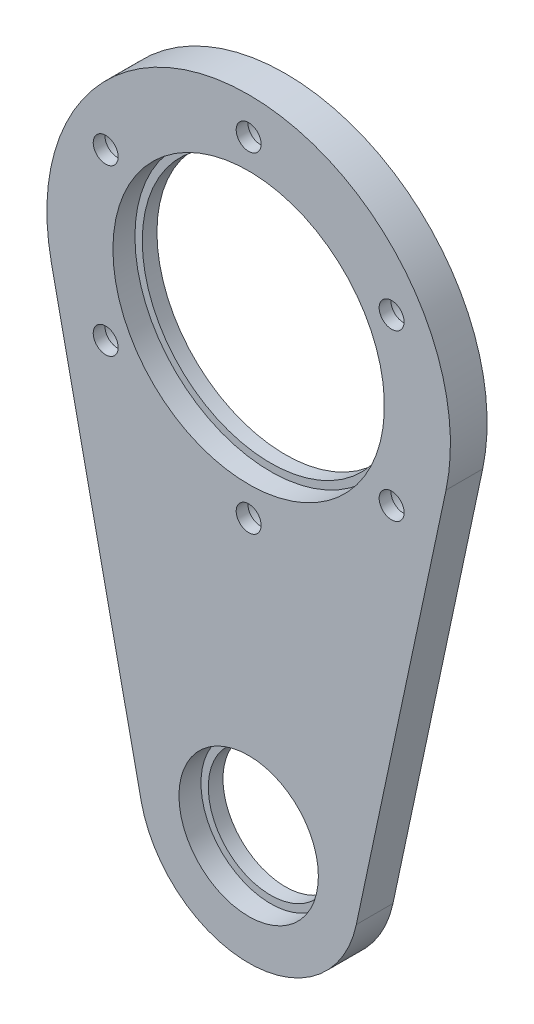
ISO-10303-21;
HEADER;
FILE_DESCRIPTION(('STEP AP214'),'2;1');
FILE_NAME('part.step','',(''),(''),'','','');
FILE_SCHEMA(('AUTOMOTIVE_DESIGN { 1 0 10303 214 1 1 1 1 }'));
ENDSEC;
DATA;
#1=APPLICATION_CONTEXT('core data for automotive mechanical design processes');
#2=APPLICATION_PROTOCOL_DEFINITION('international standard','automotive_design',2000,#1);
#3=PRODUCT_CONTEXT('',#1,'mechanical');
#4=PRODUCT('Part','Part','',(#3));
#5=PRODUCT_RELATED_PRODUCT_CATEGORY('part','',(#4));
#6=PRODUCT_DEFINITION_FORMATION('','',#4);
#7=PRODUCT_DEFINITION_CONTEXT('part definition',#1,'design');
#8=PRODUCT_DEFINITION('design','',#6,#7);
#9=PRODUCT_DEFINITION_SHAPE('','',#8);
#10=(LENGTH_UNIT() NAMED_UNIT(*) SI_UNIT(.MILLI.,.METRE.));
#11=(NAMED_UNIT(*) PLANE_ANGLE_UNIT() SI_UNIT($,.RADIAN.));
#12=(NAMED_UNIT(*) SI_UNIT($,.STERADIAN.) SOLID_ANGLE_UNIT());
#13=UNCERTAINTY_MEASURE_WITH_UNIT(LENGTH_MEASURE(1.E-05),#10,'distance_accuracy_value','');
#14=(GEOMETRIC_REPRESENTATION_CONTEXT(3) GLOBAL_UNCERTAINTY_ASSIGNED_CONTEXT((#13)) GLOBAL_UNIT_ASSIGNED_CONTEXT((#10,
#11,#12)) REPRESENTATION_CONTEXT('',''));
#15=CARTESIAN_POINT('',(0.,0.,0.));
#16=DIRECTION('',(0.,0.,1.));
#17=DIRECTION('',(1.,0.,0.));
#18=AXIS2_PLACEMENT_3D('',#15,#16,#17);
#19=CARTESIAN_POINT('',(0.,0.,-5.));
#20=DIRECTION('',(0.,0.,-1.));
#21=DIRECTION('',(-1.,0.,0.));
#22=AXIS2_PLACEMENT_3D('',#19,#20,#21);
#23=CYLINDRICAL_SURFACE('',#22,18.5);
#24=CARTESIAN_POINT('',(0.,0.,-8.));
#25=DIRECTION('',(0.,0.,-1.));
#26=DIRECTION('',(-1.,0.,0.));
#27=AXIS2_PLACEMENT_3D('',#24,#25,#26);
#28=CIRCLE('',#27,18.5);
#29=CARTESIAN_POINT('',(-18.5,0.,-8.));
#30=VERTEX_POINT('',#29);
#31=EDGE_CURVE('E96',#30,#30,#28,.F.);
#32=ORIENTED_EDGE('',*,*,#31,.T.);
#33=EDGE_LOOP('',(#32));
#34=FACE_BOUND('',#33,.T.);
#35=CARTESIAN_POINT('',(0.,0.,-11.));
#36=DIRECTION('',(0.,0.,-1.));
#37=DIRECTION('',(-1.,0.,0.));
#38=AXIS2_PLACEMENT_3D('',#35,#36,#37);
#39=CIRCLE('',#38,18.5);
#40=CARTESIAN_POINT('',(-18.5,0.,-11.));
#41=VERTEX_POINT('',#40);
#42=EDGE_CURVE('E11',#41,#41,#39,.F.);
#43=ORIENTED_EDGE('',*,*,#42,.F.);
#44=EDGE_LOOP('',(#43));
#45=FACE_BOUND('',#44,.T.);
#46=ADVANCED_FACE('F40',(#34,#45),#23,.F.);
#47=CARTESIAN_POINT('',(0.,0.,-2.));
#48=DIRECTION('',(0.,0.,1.));
#49=DIRECTION('',(1.,0.,0.));
#50=AXIS2_PLACEMENT_3D('',#47,#48,#49);
#51=CYLINDRICAL_SURFACE('',#50,27.5);
#52=DIRECTION('',(0.,0.,-1.));
#53=VECTOR('',#52,1.);
#54=CARTESIAN_POINT('',(-26.8965917786168,-5.72916666666667,-4.));
#55=LINE('',#54,#53);
#56=CARTESIAN_POINT('',(-26.8965917786168,-5.72916666666667,-8.));
#57=VERTEX_POINT('',#56);
#58=CARTESIAN_POINT('',(-26.8965917786168,-5.72916666666667,-13.));
#59=VERTEX_POINT('',#58);
#60=EDGE_CURVE('E65',#57,#59,#55,.T.);
#61=ORIENTED_EDGE('',*,*,#60,.F.);
#62=CARTESIAN_POINT('',(0.,0.,-8.));
#63=DIRECTION('',(0.,0.,-1.));
#64=DIRECTION('',(-1.,0.,0.));
#65=AXIS2_PLACEMENT_3D('',#62,#63,#64);
#66=CIRCLE('',#65,27.5);
#67=CARTESIAN_POINT('',(26.8965917786168,-5.72916666666667,-8.));
#68=VERTEX_POINT('',#67);
#69=EDGE_CURVE('E86',#57,#68,#66,.T.);
#70=ORIENTED_EDGE('',*,*,#69,.T.);
#71=DIRECTION('',(0.,0.,-1.));
#72=VECTOR('',#71,1.);
#73=CARTESIAN_POINT('',(26.8965917786168,-5.72916666666667,-4.));
#74=LINE('',#73,#72);
#75=CARTESIAN_POINT('',(26.8965917786168,-5.72916666666667,-13.));
#76=VERTEX_POINT('',#75);
#77=EDGE_CURVE('E94',#68,#76,#74,.T.);
#78=ORIENTED_EDGE('',*,*,#77,.T.);
#79=CARTESIAN_POINT('',(0.,0.,-13.));
#80=DIRECTION('',(0.,0.,-1.));
#81=DIRECTION('',(-1.,0.,0.));
#82=AXIS2_PLACEMENT_3D('',#79,#80,#81);
#83=CIRCLE('',#82,27.5);
#84=EDGE_CURVE('E49',#59,#76,#83,.T.);
#85=ORIENTED_EDGE('',*,*,#84,.F.);
#86=EDGE_LOOP('',(#61,#70,#78,#85));
#87=FACE_BOUND('',#86,.T.);
#88=ADVANCED_FACE('F42',(#87),#51,.T.);
#89=CARTESIAN_POINT('',(0.,0.,-13.));
#90=DIRECTION('',(0.,0.,-1.));
#91=DIRECTION('',(-1.,0.,0.));
#92=AXIS2_PLACEMENT_3D('',#89,#90,#91);
#93=PLANE('',#92);
#94=CARTESIAN_POINT('',(-19.4855715851497,11.2500000000002,-13.));
#95=DIRECTION('',(0.,0.,-1.));
#96=DIRECTION('',(-1.,0.,0.));
#97=AXIS2_PLACEMENT_3D('',#94,#95,#96);
#98=CIRCLE('',#97,3.25);
#99=CARTESIAN_POINT('',(-22.7355715851497,11.2500000000002,-13.));
#100=VERTEX_POINT('',#99);
#101=EDGE_CURVE('E331',#100,#100,#98,.T.);
#102=ORIENTED_EDGE('',*,*,#101,.F.);
#103=EDGE_LOOP('',(#102));
#104=FACE_BOUND('',#103,.T.);
#105=CARTESIAN_POINT('',(-19.48557158515,-11.2499999999998,-13.));
#106=DIRECTION('',(0.,0.,-1.));
#107=DIRECTION('',(-1.,0.,0.));
#108=AXIS2_PLACEMENT_3D('',#105,#106,#107);
#109=CIRCLE('',#108,3.25);
#110=CARTESIAN_POINT('',(-22.73557158515,-11.2499999999998,-13.));
#111=VERTEX_POINT('',#110);
#112=EDGE_CURVE('E150',#111,#111,#109,.T.);
#113=ORIENTED_EDGE('',*,*,#112,.F.);
#114=EDGE_LOOP('',(#113));
#115=FACE_BOUND('',#114,.T.);
#116=CARTESIAN_POINT('',(0.,-22.5,-13.));
#117=DIRECTION('',(0.,0.,-1.));
#118=DIRECTION('',(-1.,0.,0.));
#119=AXIS2_PLACEMENT_3D('',#116,#117,#118);
#120=CIRCLE('',#119,3.25);
#121=CARTESIAN_POINT('',(-3.25,-22.5,-13.));
#122=VERTEX_POINT('',#121);
#123=EDGE_CURVE('E137',#122,#122,#120,.T.);
#124=ORIENTED_EDGE('',*,*,#123,.F.);
#125=EDGE_LOOP('',(#124));
#126=FACE_BOUND('',#125,.T.);
#127=CARTESIAN_POINT('',(19.4855715851498,-11.2500000000001,-13.));
#128=DIRECTION('',(0.,0.,-1.));
#129=DIRECTION('',(-1.,0.,0.));
#130=AXIS2_PLACEMENT_3D('',#127,#128,#129);
#131=CIRCLE('',#130,3.25);
#132=CARTESIAN_POINT('',(16.2355715851498,-11.2500000000001,-13.));
#133=VERTEX_POINT('',#132);
#134=EDGE_CURVE('E133',#133,#133,#131,.T.);
#135=ORIENTED_EDGE('',*,*,#134,.F.);
#136=EDGE_LOOP('',(#135));
#137=FACE_BOUND('',#136,.T.);
#138=CARTESIAN_POINT('',(19.4855715851499,11.25,-13.));
#139=DIRECTION('',(0.,0.,-1.));
#140=DIRECTION('',(-1.,0.,0.));
#141=AXIS2_PLACEMENT_3D('',#138,#139,#140);
#142=CIRCLE('',#141,3.25);
#143=CARTESIAN_POINT('',(16.2355715851499,11.25,-13.));
#144=VERTEX_POINT('',#143);
#145=EDGE_CURVE('E129',#144,#144,#142,.T.);
#146=ORIENTED_EDGE('',*,*,#145,.F.);
#147=EDGE_LOOP('',(#146));
#148=FACE_BOUND('',#147,.T.);
#149=CARTESIAN_POINT('',(0.,22.5,-13.));
#150=DIRECTION('',(0.,0.,-1.));
#151=DIRECTION('',(-1.,0.,0.));
#152=AXIS2_PLACEMENT_3D('',#149,#150,#151);
#153=CIRCLE('',#152,3.25);
#154=CARTESIAN_POINT('',(-3.25,22.5,-13.));
#155=VERTEX_POINT('',#154);
#156=EDGE_CURVE('E124',#155,#155,#153,.T.);
#157=ORIENTED_EDGE('',*,*,#156,.F.);
#158=EDGE_LOOP('',(#157));
#159=FACE_BOUND('',#158,.T.);
#160=CARTESIAN_POINT('',(0.,-60.,-13.));
#161=DIRECTION('',(0.,0.,1.));
#162=DIRECTION('',(1.,0.,0.));
#163=AXIS2_PLACEMENT_3D('',#160,#161,#162);
#164=CIRCLE('',#163,8.50000000000001);
#165=CARTESIAN_POINT('',(8.5,-60.,-13.));
#166=VERTEX_POINT('',#165);
#167=EDGE_CURVE('E188',#166,#166,#164,.T.);
#168=ORIENTED_EDGE('',*,*,#167,.T.);
#169=EDGE_LOOP('',(#168));
#170=FACE_BOUND('',#169,.T.);
#171=ORIENTED_EDGE('',*,*,#84,.T.);
#172=DIRECTION('',(-0.208333333333333,-0.978057882858792,0.));
#173=VECTOR('',#172,1.);
#174=CARTESIAN_POINT('',(26.8965917786168,-5.72916666666667,-13.));
#175=LINE('',#174,#173);
#176=CARTESIAN_POINT('',(14.6708682428819,-63.125,-13.));
#177=VERTEX_POINT('',#176);
#178=EDGE_CURVE('E101',#76,#177,#175,.T.);
#179=ORIENTED_EDGE('',*,*,#178,.T.);
#180=CARTESIAN_POINT('',(0.,-60.,-13.));
#181=DIRECTION('',(0.,0.,-1.));
#182=DIRECTION('',(-1.,0.,0.));
#183=AXIS2_PLACEMENT_3D('',#180,#181,#182);
#184=CIRCLE('',#183,15.);
#185=CARTESIAN_POINT('',(-14.6708682428819,-63.125,-13.));
#186=VERTEX_POINT('',#185);
#187=EDGE_CURVE('E108',#177,#186,#184,.T.);
#188=ORIENTED_EDGE('',*,*,#187,.T.);
#189=DIRECTION('',(-0.208333333333333,0.978057882858792,0.));
#190=VECTOR('',#189,1.);
#191=CARTESIAN_POINT('',(-26.8965917786168,-5.72916666666667,-13.));
#192=LINE('',#191,#190);
#193=EDGE_CURVE('E104',#186,#59,#192,.T.);
#194=ORIENTED_EDGE('',*,*,#193,.T.);
#195=EDGE_LOOP('',(#171,#179,#188,#194));
#196=FACE_BOUND('',#195,.T.);
#197=CARTESIAN_POINT('',(0.,0.,-13.));
#198=DIRECTION('',(0.,0.,-1.));
#199=DIRECTION('',(-1.,0.,0.));
#200=AXIS2_PLACEMENT_3D('',#197,#198,#199);
#201=CIRCLE('',#200,17.5);
#202=CARTESIAN_POINT('',(-17.5,0.,-13.));
#203=VERTEX_POINT('',#202);
#204=EDGE_CURVE('E119',#203,#203,#201,.T.);
#205=ORIENTED_EDGE('',*,*,#204,.F.);
#206=EDGE_LOOP('',(#205));
#207=FACE_BOUND('',#206,.T.);
#208=ADVANCED_FACE('F204',(#104,#115,#126,#137,#148,#159,#170,#196,#207),#93,.T.);
#209=CARTESIAN_POINT('',(-26.8965917786168,-5.72916666666667,-4.));
#210=DIRECTION('',(-0.978057882858792,-0.208333333333333,0.));
#211=DIRECTION('',(0.208333333333333,-0.978057882858792,0.));
#212=AXIS2_PLACEMENT_3D('',#209,#210,#211);
#213=PLANE('',#212);
#214=DIRECTION('',(0.208333333333333,-0.978057882858792,0.));
#215=VECTOR('',#214,1.);
#216=CARTESIAN_POINT('',(-26.8965917786168,-5.72916666666667,-8.));
#217=LINE('',#216,#215);
#218=CARTESIAN_POINT('',(-14.6708682428819,-63.125,-8.));
#219=VERTEX_POINT('',#218);
#220=EDGE_CURVE('E97',#57,#219,#217,.T.);
#221=ORIENTED_EDGE('',*,*,#220,.F.);
#222=ORIENTED_EDGE('',*,*,#60,.T.);
#223=ORIENTED_EDGE('',*,*,#193,.F.);
#224=DIRECTION('',(0.,0.,-1.));
#225=VECTOR('',#224,1.);
#226=CARTESIAN_POINT('',(-14.6708682428819,-63.125,-4.));
#227=LINE('',#226,#225);
#228=EDGE_CURVE('E106',#219,#186,#227,.T.);
#229=ORIENTED_EDGE('',*,*,#228,.F.);
#230=EDGE_LOOP('',(#221,#222,#223,#229));
#231=FACE_BOUND('',#230,.T.);
#232=ADVANCED_FACE('F206',(#231),#213,.T.);
#233=CARTESIAN_POINT('',(0.,-60.,-4.));
#234=DIRECTION('',(0.,0.,-1.));
#235=DIRECTION('',(-1.,0.,0.));
#236=AXIS2_PLACEMENT_3D('',#233,#234,#235);
#237=CYLINDRICAL_SURFACE('',#236,15.);
#238=CARTESIAN_POINT('',(0.,-60.,-8.));
#239=DIRECTION('',(0.,0.,-1.));
#240=DIRECTION('',(-1.,0.,0.));
#241=AXIS2_PLACEMENT_3D('',#238,#239,#240);
#242=CIRCLE('',#241,15.);
#243=CARTESIAN_POINT('',(14.6708682428819,-63.125,-8.));
#244=VERTEX_POINT('',#243);
#245=EDGE_CURVE('E57',#219,#244,#242,.F.);
#246=ORIENTED_EDGE('',*,*,#245,.F.);
#247=ORIENTED_EDGE('',*,*,#228,.T.);
#248=ORIENTED_EDGE('',*,*,#187,.F.);
#249=DIRECTION('',(0.,0.,-1.));
#250=VECTOR('',#249,1.);
#251=CARTESIAN_POINT('',(14.6708682428819,-63.125,-4.));
#252=LINE('',#251,#250);
#253=EDGE_CURVE('E103',#244,#177,#252,.T.);
#254=ORIENTED_EDGE('',*,*,#253,.F.);
#255=EDGE_LOOP('',(#246,#247,#248,#254));
#256=FACE_BOUND('',#255,.T.);
#257=ADVANCED_FACE('F202',(#256),#237,.T.);
#258=CARTESIAN_POINT('',(26.8965917786168,-5.72916666666667,-4.));
#259=DIRECTION('',(0.978057882858792,-0.208333333333333,0.));
#260=DIRECTION('',(0.208333333333333,0.978057882858792,0.));
#261=AXIS2_PLACEMENT_3D('',#258,#259,#260);
#262=PLANE('',#261);
#263=DIRECTION('',(0.208333333333333,0.978057882858792,0.));
#264=VECTOR('',#263,1.);
#265=CARTESIAN_POINT('',(26.8965917786168,-5.72916666666667,-8.));
#266=LINE('',#265,#264);
#267=EDGE_CURVE('E82',#244,#68,#266,.T.);
#268=ORIENTED_EDGE('',*,*,#267,.F.);
#269=ORIENTED_EDGE('',*,*,#253,.T.);
#270=ORIENTED_EDGE('',*,*,#178,.F.);
#271=ORIENTED_EDGE('',*,*,#77,.F.);
#272=EDGE_LOOP('',(#268,#269,#270,#271));
#273=FACE_BOUND('',#272,.T.);
#274=ADVANCED_FACE('F99',(#273),#262,.T.);
#275=CARTESIAN_POINT('',(0.,-60.,-11.));
#276=DIRECTION('',(0.,0.,1.));
#277=DIRECTION('',(1.,0.,0.));
#278=AXIS2_PLACEMENT_3D('',#275,#276,#277);
#279=CYLINDRICAL_SURFACE('',#278,9.5);
#280=CARTESIAN_POINT('',(0.,-60.,-8.));
#281=DIRECTION('',(0.,0.,-1.));
#282=DIRECTION('',(-1.,0.,0.));
#283=AXIS2_PLACEMENT_3D('',#280,#281,#282);
#284=CIRCLE('',#283,9.5);
#285=CARTESIAN_POINT('',(-9.5,-60.,-8.));
#286=VERTEX_POINT('',#285);
#287=EDGE_CURVE('E90',#286,#286,#284,.F.);
#288=ORIENTED_EDGE('',*,*,#287,.T.);
#289=EDGE_LOOP('',(#288));
#290=FACE_BOUND('',#289,.T.);
#291=CARTESIAN_POINT('',(0.,-60.,-11.));
#292=DIRECTION('',(0.,0.,1.));
#293=DIRECTION('',(1.,0.,0.));
#294=AXIS2_PLACEMENT_3D('',#291,#292,#293);
#295=CIRCLE('',#294,9.5);
#296=CARTESIAN_POINT('',(9.49999999999999,-60.,-11.));
#297=VERTEX_POINT('',#296);
#298=EDGE_CURVE('E191',#297,#297,#295,.T.);
#299=ORIENTED_EDGE('',*,*,#298,.F.);
#300=EDGE_LOOP('',(#299));
#301=FACE_BOUND('',#300,.T.);
#302=ADVANCED_FACE('F225',(#290,#301),#279,.F.);
#303=CARTESIAN_POINT('',(0.,-60.,-11.));
#304=DIRECTION('',(0.,0.,1.));
#305=DIRECTION('',(1.,0.,0.));
#306=AXIS2_PLACEMENT_3D('',#303,#304,#305);
#307=PLANE('',#306);
#308=CARTESIAN_POINT('',(0.,-60.,-11.));
#309=DIRECTION('',(0.,0.,1.));
#310=DIRECTION('',(1.,0.,0.));
#311=AXIS2_PLACEMENT_3D('',#308,#309,#310);
#312=CIRCLE('',#311,8.50000000000001);
#313=CARTESIAN_POINT('',(8.5,-60.,-11.));
#314=VERTEX_POINT('',#313);
#315=EDGE_CURVE('E187',#314,#314,#312,.T.);
#316=ORIENTED_EDGE('',*,*,#315,.F.);
#317=EDGE_LOOP('',(#316));
#318=FACE_BOUND('',#317,.T.);
#319=ORIENTED_EDGE('',*,*,#298,.T.);
#320=EDGE_LOOP('',(#319));
#321=FACE_BOUND('',#320,.T.);
#322=ADVANCED_FACE('F229',(#318,#321),#307,.T.);
#323=CARTESIAN_POINT('',(0.,-60.,-13.));
#324=DIRECTION('',(0.,0.,1.));
#325=DIRECTION('',(1.,0.,0.));
#326=AXIS2_PLACEMENT_3D('',#323,#324,#325);
#327=CYLINDRICAL_SURFACE('',#326,8.50000000000001);
#328=ORIENTED_EDGE('',*,*,#167,.F.);
#329=EDGE_LOOP('',(#328));
#330=FACE_BOUND('',#329,.T.);
#331=ORIENTED_EDGE('',*,*,#315,.T.);
#332=EDGE_LOOP('',(#331));
#333=FACE_BOUND('',#332,.T.);
#334=ADVANCED_FACE('F234',(#330,#333),#327,.F.);
#335=CARTESIAN_POINT('',(-35.5676389386564,-176.5,-8.));
#336=DIRECTION('',(0.,0.,-1.));
#337=DIRECTION('',(-1.,0.,0.));
#338=AXIS2_PLACEMENT_3D('',#335,#336,#337);
#339=PLANE('',#338);
#340=CARTESIAN_POINT('',(-19.4855715851497,11.2500000000002,-8.));
#341=DIRECTION('',(0.,0.,-1.));
#342=DIRECTION('',(-1.,0.,0.));
#343=AXIS2_PLACEMENT_3D('',#340,#341,#342);
#344=CIRCLE('',#343,1.69999999999996);
#345=CARTESIAN_POINT('',(-21.1855715851497,11.2500000000002,-8.));
#346=VERTEX_POINT('',#345);
#347=EDGE_CURVE('E44',#346,#346,#344,.T.);
#348=ORIENTED_EDGE('',*,*,#347,.T.);
#349=EDGE_LOOP('',(#348));
#350=FACE_BOUND('',#349,.T.);
#351=CARTESIAN_POINT('',(-19.48557158515,-11.2499999999998,-8.));
#352=DIRECTION('',(0.,0.,-1.));
#353=DIRECTION('',(-1.,0.,0.));
#354=AXIS2_PLACEMENT_3D('',#351,#352,#353);
#355=CIRCLE('',#354,1.69999999999996);
#356=CARTESIAN_POINT('',(-21.1855715851499,-11.2499999999998,-8.));
#357=VERTEX_POINT('',#356);
#358=EDGE_CURVE('E135',#357,#357,#355,.T.);
#359=ORIENTED_EDGE('',*,*,#358,.T.);
#360=EDGE_LOOP('',(#359));
#361=FACE_BOUND('',#360,.T.);
#362=CARTESIAN_POINT('',(0.,-22.5,-8.));
#363=DIRECTION('',(0.,0.,-1.));
#364=DIRECTION('',(-1.,0.,0.));
#365=AXIS2_PLACEMENT_3D('',#362,#363,#364);
#366=CIRCLE('',#365,1.69999999999996);
#367=CARTESIAN_POINT('',(-1.69999999999996,-22.5,-8.));
#368=VERTEX_POINT('',#367);
#369=EDGE_CURVE('E131',#368,#368,#366,.T.);
#370=ORIENTED_EDGE('',*,*,#369,.T.);
#371=EDGE_LOOP('',(#370));
#372=FACE_BOUND('',#371,.T.);
#373=CARTESIAN_POINT('',(19.4855715851498,-11.2500000000001,-8.));
#374=DIRECTION('',(0.,0.,-1.));
#375=DIRECTION('',(-1.,0.,0.));
#376=AXIS2_PLACEMENT_3D('',#373,#374,#375);
#377=CIRCLE('',#376,1.69999999999996);
#378=CARTESIAN_POINT('',(17.7855715851499,-11.2500000000001,-8.));
#379=VERTEX_POINT('',#378);
#380=EDGE_CURVE('E126',#379,#379,#377,.T.);
#381=ORIENTED_EDGE('',*,*,#380,.T.);
#382=EDGE_LOOP('',(#381));
#383=FACE_BOUND('',#382,.T.);
#384=CARTESIAN_POINT('',(19.4855715851499,11.25,-8.));
#385=DIRECTION('',(0.,0.,-1.));
#386=DIRECTION('',(-1.,0.,0.));
#387=AXIS2_PLACEMENT_3D('',#384,#385,#386);
#388=CIRCLE('',#387,1.69999999999996);
#389=CARTESIAN_POINT('',(17.7855715851499,11.25,-8.));
#390=VERTEX_POINT('',#389);
#391=EDGE_CURVE('E121',#390,#390,#388,.T.);
#392=ORIENTED_EDGE('',*,*,#391,.T.);
#393=EDGE_LOOP('',(#392));
#394=FACE_BOUND('',#393,.T.);
#395=CARTESIAN_POINT('',(0.,22.5,-8.));
#396=DIRECTION('',(0.,0.,-1.));
#397=DIRECTION('',(-1.,0.,0.));
#398=AXIS2_PLACEMENT_3D('',#395,#396,#397);
#399=CIRCLE('',#398,1.69999999999996);
#400=CARTESIAN_POINT('',(-1.69999999999996,22.5,-8.));
#401=VERTEX_POINT('',#400);
#402=EDGE_CURVE('E116',#401,#401,#399,.T.);
#403=ORIENTED_EDGE('',*,*,#402,.T.);
#404=EDGE_LOOP('',(#403));
#405=FACE_BOUND('',#404,.T.);
#406=ORIENTED_EDGE('',*,*,#220,.T.);
#407=ORIENTED_EDGE('',*,*,#245,.T.);
#408=ORIENTED_EDGE('',*,*,#267,.T.);
#409=ORIENTED_EDGE('',*,*,#69,.F.);
#410=EDGE_LOOP('',(#406,#407,#408,#409));
#411=FACE_BOUND('',#410,.T.);
#412=ORIENTED_EDGE('',*,*,#287,.F.);
#413=EDGE_LOOP('',(#412));
#414=FACE_BOUND('',#413,.T.);
#415=ORIENTED_EDGE('',*,*,#31,.F.);
#416=EDGE_LOOP('',(#415));
#417=FACE_BOUND('',#416,.T.);
#418=ADVANCED_FACE('F84',(#350,#361,#372,#383,#394,#405,#411,#414,#417),#339,.F.);
#419=CARTESIAN_POINT('',(0.,0.,-11.));
#420=DIRECTION('',(0.,0.,-1.));
#421=DIRECTION('',(-1.,0.,0.));
#422=AXIS2_PLACEMENT_3D('',#419,#420,#421);
#423=PLANE('',#422);
#424=CARTESIAN_POINT('',(0.,0.,-11.));
#425=DIRECTION('',(0.,0.,-1.));
#426=DIRECTION('',(-1.,0.,0.));
#427=AXIS2_PLACEMENT_3D('',#424,#425,#426);
#428=CIRCLE('',#427,17.5);
#429=CARTESIAN_POINT('',(-17.5,0.,-11.));
#430=VERTEX_POINT('',#429);
#431=EDGE_CURVE('E114',#430,#430,#428,.T.);
#432=ORIENTED_EDGE('',*,*,#431,.T.);
#433=EDGE_LOOP('',(#432));
#434=FACE_BOUND('',#433,.T.);
#435=ORIENTED_EDGE('',*,*,#42,.T.);
#436=EDGE_LOOP('',(#435));
#437=FACE_BOUND('',#436,.T.);
#438=ADVANCED_FACE('F244',(#434,#437),#423,.F.);
#439=CARTESIAN_POINT('',(0.,0.,-11.));
#440=DIRECTION('',(0.,0.,-1.));
#441=DIRECTION('',(-1.,0.,0.));
#442=AXIS2_PLACEMENT_3D('',#439,#440,#441);
#443=CYLINDRICAL_SURFACE('',#442,17.5);
#444=ORIENTED_EDGE('',*,*,#431,.F.);
#445=EDGE_LOOP('',(#444));
#446=FACE_BOUND('',#445,.T.);
#447=ORIENTED_EDGE('',*,*,#204,.T.);
#448=EDGE_LOOP('',(#447));
#449=FACE_BOUND('',#448,.T.);
#450=ADVANCED_FACE('F248',(#446,#449),#443,.F.);
#451=CARTESIAN_POINT('',(0.,22.5,-13.));
#452=DIRECTION('',(0.,0.,-1.));
#453=DIRECTION('',(-1.,0.,0.));
#454=AXIS2_PLACEMENT_3D('',#451,#452,#453);
#455=CYLINDRICAL_SURFACE('',#454,1.69999999999996);
#456=CARTESIAN_POINT('',(0.,22.5,-9.60000000000001));
#457=DIRECTION('',(0.,0.,-1.));
#458=DIRECTION('',(-1.,0.,0.));
#459=AXIS2_PLACEMENT_3D('',#456,#457,#458);
#460=CIRCLE('',#459,1.69999999999997);
#461=CARTESIAN_POINT('',(-1.69999999999997,22.5,-9.60000000000001));
#462=VERTEX_POINT('',#461);
#463=EDGE_CURVE('E120',#462,#462,#460,.T.);
#464=ORIENTED_EDGE('',*,*,#463,.T.);
#465=EDGE_LOOP('',(#464));
#466=FACE_BOUND('',#465,.T.);
#467=ORIENTED_EDGE('',*,*,#402,.F.);
#468=EDGE_LOOP('',(#467));
#469=FACE_BOUND('',#468,.T.);
#470=ADVANCED_FACE('F252',(#466,#469),#455,.F.);
#471=CARTESIAN_POINT('',(1.69999999999997,22.5,-9.60000000000001));
#472=DIRECTION('',(0.,0.,1.));
#473=DIRECTION('',(1.,0.,0.));
#474=AXIS2_PLACEMENT_3D('',#471,#472,#473);
#475=PLANE('',#474);
#476=ORIENTED_EDGE('',*,*,#463,.F.);
#477=EDGE_LOOP('',(#476));
#478=FACE_BOUND('',#477,.T.);
#479=CARTESIAN_POINT('',(0.,22.5,-9.6));
#480=DIRECTION('',(0.,0.,-1.));
#481=DIRECTION('',(-1.,0.,0.));
#482=AXIS2_PLACEMENT_3D('',#479,#480,#481);
#483=CIRCLE('',#482,3.25);
#484=CARTESIAN_POINT('',(-3.25,22.5,-9.6));
#485=VERTEX_POINT('',#484);
#486=EDGE_CURVE('E174',#485,#485,#483,.T.);
#487=ORIENTED_EDGE('',*,*,#486,.T.);
#488=EDGE_LOOP('',(#487));
#489=FACE_BOUND('',#488,.T.);
#490=ADVANCED_FACE('F256',(#478,#489),#475,.F.);
#491=CARTESIAN_POINT('',(0.,22.5,-13.));
#492=DIRECTION('',(0.,0.,-1.));
#493=DIRECTION('',(-1.,0.,0.));
#494=AXIS2_PLACEMENT_3D('',#491,#492,#493);
#495=CYLINDRICAL_SURFACE('',#494,3.25);
#496=ORIENTED_EDGE('',*,*,#486,.F.);
#497=EDGE_LOOP('',(#496));
#498=FACE_BOUND('',#497,.T.);
#499=ORIENTED_EDGE('',*,*,#156,.T.);
#500=EDGE_LOOP('',(#499));
#501=FACE_BOUND('',#500,.T.);
#502=ADVANCED_FACE('F260',(#498,#501),#495,.F.);
#503=CARTESIAN_POINT('',(19.4855715851499,11.25,-13.));
#504=DIRECTION('',(0.,0.,-1.));
#505=DIRECTION('',(-1.,0.,0.));
#506=AXIS2_PLACEMENT_3D('',#503,#504,#505);
#507=CYLINDRICAL_SURFACE('',#506,1.69999999999996);
#508=CARTESIAN_POINT('',(19.4855715851499,11.25,-9.60000000000001));
#509=DIRECTION('',(0.,0.,-1.));
#510=DIRECTION('',(-1.,0.,0.));
#511=AXIS2_PLACEMENT_3D('',#508,#509,#510);
#512=CIRCLE('',#511,1.69999999999997);
#513=CARTESIAN_POINT('',(17.7855715851499,11.25,-9.60000000000001));
#514=VERTEX_POINT('',#513);
#515=EDGE_CURVE('E125',#514,#514,#512,.T.);
#516=ORIENTED_EDGE('',*,*,#515,.T.);
#517=EDGE_LOOP('',(#516));
#518=FACE_BOUND('',#517,.T.);
#519=ORIENTED_EDGE('',*,*,#391,.F.);
#520=EDGE_LOOP('',(#519));
#521=FACE_BOUND('',#520,.T.);
#522=ADVANCED_FACE('F264',(#518,#521),#507,.F.);
#523=CARTESIAN_POINT('',(21.1855715851499,11.25,-9.60000000000001));
#524=DIRECTION('',(0.,0.,1.));
#525=DIRECTION('',(1.,0.,0.));
#526=AXIS2_PLACEMENT_3D('',#523,#524,#525);
#527=PLANE('',#526);
#528=ORIENTED_EDGE('',*,*,#515,.F.);
#529=EDGE_LOOP('',(#528));
#530=FACE_BOUND('',#529,.T.);
#531=CARTESIAN_POINT('',(19.4855715851499,11.25,-9.6));
#532=DIRECTION('',(0.,0.,-1.));
#533=DIRECTION('',(-1.,0.,0.));
#534=AXIS2_PLACEMENT_3D('',#531,#532,#533);
#535=CIRCLE('',#534,3.25);
#536=CARTESIAN_POINT('',(16.2355715851499,11.25,-9.6));
#537=VERTEX_POINT('',#536);
#538=EDGE_CURVE('E167',#537,#537,#535,.T.);
#539=ORIENTED_EDGE('',*,*,#538,.T.);
#540=EDGE_LOOP('',(#539));
#541=FACE_BOUND('',#540,.T.);
#542=ADVANCED_FACE('F268',(#530,#541),#527,.F.);
#543=CARTESIAN_POINT('',(19.4855715851499,11.25,-13.));
#544=DIRECTION('',(0.,0.,-1.));
#545=DIRECTION('',(-1.,0.,0.));
#546=AXIS2_PLACEMENT_3D('',#543,#544,#545);
#547=CYLINDRICAL_SURFACE('',#546,3.25);
#548=ORIENTED_EDGE('',*,*,#538,.F.);
#549=EDGE_LOOP('',(#548));
#550=FACE_BOUND('',#549,.T.);
#551=ORIENTED_EDGE('',*,*,#145,.T.);
#552=EDGE_LOOP('',(#551));
#553=FACE_BOUND('',#552,.T.);
#554=ADVANCED_FACE('F272',(#550,#553),#547,.F.);
#555=CARTESIAN_POINT('',(19.4855715851498,-11.2500000000001,-13.));
#556=DIRECTION('',(0.,0.,-1.));
#557=DIRECTION('',(-1.,0.,0.));
#558=AXIS2_PLACEMENT_3D('',#555,#556,#557);
#559=CYLINDRICAL_SURFACE('',#558,1.69999999999996);
#560=CARTESIAN_POINT('',(19.4855715851498,-11.2500000000001,-9.60000000000001));
#561=DIRECTION('',(0.,0.,-1.));
#562=DIRECTION('',(-1.,0.,0.));
#563=AXIS2_PLACEMENT_3D('',#560,#561,#562);
#564=CIRCLE('',#563,1.69999999999997);
#565=CARTESIAN_POINT('',(17.7855715851499,-11.2500000000001,-9.60000000000001));
#566=VERTEX_POINT('',#565);
#567=EDGE_CURVE('E130',#566,#566,#564,.T.);
#568=ORIENTED_EDGE('',*,*,#567,.T.);
#569=EDGE_LOOP('',(#568));
#570=FACE_BOUND('',#569,.T.);
#571=ORIENTED_EDGE('',*,*,#380,.F.);
#572=EDGE_LOOP('',(#571));
#573=FACE_BOUND('',#572,.T.);
#574=ADVANCED_FACE('F276',(#570,#573),#559,.F.);
#575=CARTESIAN_POINT('',(21.1855715851498,-11.2500000000001,-9.60000000000001));
#576=DIRECTION('',(0.,0.,1.));
#577=DIRECTION('',(1.,0.,0.));
#578=AXIS2_PLACEMENT_3D('',#575,#576,#577);
#579=PLANE('',#578);
#580=ORIENTED_EDGE('',*,*,#567,.F.);
#581=EDGE_LOOP('',(#580));
#582=FACE_BOUND('',#581,.T.);
#583=CARTESIAN_POINT('',(19.4855715851498,-11.2500000000001,-9.6));
#584=DIRECTION('',(0.,0.,-1.));
#585=DIRECTION('',(-1.,0.,0.));
#586=AXIS2_PLACEMENT_3D('',#583,#584,#585);
#587=CIRCLE('',#586,3.25);
#588=CARTESIAN_POINT('',(16.2355715851498,-11.2500000000001,-9.6));
#589=VERTEX_POINT('',#588);
#590=EDGE_CURVE('E160',#589,#589,#587,.T.);
#591=ORIENTED_EDGE('',*,*,#590,.T.);
#592=EDGE_LOOP('',(#591));
#593=FACE_BOUND('',#592,.T.);
#594=ADVANCED_FACE('F280',(#582,#593),#579,.F.);
#595=CARTESIAN_POINT('',(19.4855715851498,-11.2500000000001,-13.));
#596=DIRECTION('',(0.,0.,-1.));
#597=DIRECTION('',(-1.,0.,0.));
#598=AXIS2_PLACEMENT_3D('',#595,#596,#597);
#599=CYLINDRICAL_SURFACE('',#598,3.25);
#600=ORIENTED_EDGE('',*,*,#590,.F.);
#601=EDGE_LOOP('',(#600));
#602=FACE_BOUND('',#601,.T.);
#603=ORIENTED_EDGE('',*,*,#134,.T.);
#604=EDGE_LOOP('',(#603));
#605=FACE_BOUND('',#604,.T.);
#606=ADVANCED_FACE('F284',(#602,#605),#599,.F.);
#607=CARTESIAN_POINT('',(0.,-22.5,-13.));
#608=DIRECTION('',(0.,0.,-1.));
#609=DIRECTION('',(-1.,0.,0.));
#610=AXIS2_PLACEMENT_3D('',#607,#608,#609);
#611=CYLINDRICAL_SURFACE('',#610,1.69999999999996);
#612=CARTESIAN_POINT('',(0.,-22.5,-9.60000000000001));
#613=DIRECTION('',(0.,0.,-1.));
#614=DIRECTION('',(-1.,0.,0.));
#615=AXIS2_PLACEMENT_3D('',#612,#613,#614);
#616=CIRCLE('',#615,1.69999999999997);
#617=CARTESIAN_POINT('',(-1.69999999999997,-22.5,-9.60000000000001));
#618=VERTEX_POINT('',#617);
#619=EDGE_CURVE('E134',#618,#618,#616,.T.);
#620=ORIENTED_EDGE('',*,*,#619,.T.);
#621=EDGE_LOOP('',(#620));
#622=FACE_BOUND('',#621,.T.);
#623=ORIENTED_EDGE('',*,*,#369,.F.);
#624=EDGE_LOOP('',(#623));
#625=FACE_BOUND('',#624,.T.);
#626=ADVANCED_FACE('F288',(#622,#625),#611,.F.);
#627=CARTESIAN_POINT('',(1.69999999999997,-22.5,-9.60000000000001));
#628=DIRECTION('',(0.,0.,1.));
#629=DIRECTION('',(1.,0.,0.));
#630=AXIS2_PLACEMENT_3D('',#627,#628,#629);
#631=PLANE('',#630);
#632=ORIENTED_EDGE('',*,*,#619,.F.);
#633=EDGE_LOOP('',(#632));
#634=FACE_BOUND('',#633,.T.);
#635=CARTESIAN_POINT('',(0.,-22.5,-9.6));
#636=DIRECTION('',(0.,0.,-1.));
#637=DIRECTION('',(-1.,0.,0.));
#638=AXIS2_PLACEMENT_3D('',#635,#636,#637);
#639=CIRCLE('',#638,3.25);
#640=CARTESIAN_POINT('',(-3.25,-22.5,-9.6));
#641=VERTEX_POINT('',#640);
#642=EDGE_CURVE('E142',#641,#641,#639,.T.);
#643=ORIENTED_EDGE('',*,*,#642,.T.);
#644=EDGE_LOOP('',(#643));
#645=FACE_BOUND('',#644,.T.);
#646=ADVANCED_FACE('F292',(#634,#645),#631,.F.);
#647=CARTESIAN_POINT('',(0.,-22.5,-13.));
#648=DIRECTION('',(0.,0.,-1.));
#649=DIRECTION('',(-1.,0.,0.));
#650=AXIS2_PLACEMENT_3D('',#647,#648,#649);
#651=CYLINDRICAL_SURFACE('',#650,3.25);
#652=ORIENTED_EDGE('',*,*,#642,.F.);
#653=EDGE_LOOP('',(#652));
#654=FACE_BOUND('',#653,.T.);
#655=ORIENTED_EDGE('',*,*,#123,.T.);
#656=EDGE_LOOP('',(#655));
#657=FACE_BOUND('',#656,.T.);
#658=ADVANCED_FACE('F296',(#654,#657),#651,.F.);
#659=CARTESIAN_POINT('',(-19.48557158515,-11.2499999999998,-13.));
#660=DIRECTION('',(0.,0.,-1.));
#661=DIRECTION('',(-1.,0.,0.));
#662=AXIS2_PLACEMENT_3D('',#659,#660,#661);
#663=CYLINDRICAL_SURFACE('',#662,1.69999999999996);
#664=CARTESIAN_POINT('',(-19.48557158515,-11.2499999999998,-9.60000000000001));
#665=DIRECTION('',(0.,0.,-1.));
#666=DIRECTION('',(-1.,0.,0.));
#667=AXIS2_PLACEMENT_3D('',#664,#665,#666);
#668=CIRCLE('',#667,1.69999999999997);
#669=CARTESIAN_POINT('',(-21.18557158515,-11.2499999999998,-9.60000000000001));
#670=VERTEX_POINT('',#669);
#671=EDGE_CURVE('E138',#670,#670,#668,.T.);
#672=ORIENTED_EDGE('',*,*,#671,.T.);
#673=EDGE_LOOP('',(#672));
#674=FACE_BOUND('',#673,.T.);
#675=ORIENTED_EDGE('',*,*,#358,.F.);
#676=EDGE_LOOP('',(#675));
#677=FACE_BOUND('',#676,.T.);
#678=ADVANCED_FACE('F300',(#674,#677),#663,.F.);
#679=CARTESIAN_POINT('',(-17.78557158515,-11.2499999999998,-9.60000000000001));
#680=DIRECTION('',(0.,0.,1.));
#681=DIRECTION('',(1.,0.,0.));
#682=AXIS2_PLACEMENT_3D('',#679,#680,#681);
#683=PLANE('',#682);
#684=ORIENTED_EDGE('',*,*,#671,.F.);
#685=EDGE_LOOP('',(#684));
#686=FACE_BOUND('',#685,.T.);
#687=CARTESIAN_POINT('',(-19.48557158515,-11.2499999999998,-9.6));
#688=DIRECTION('',(0.,0.,-1.));
#689=DIRECTION('',(-1.,0.,0.));
#690=AXIS2_PLACEMENT_3D('',#687,#688,#689);
#691=CIRCLE('',#690,3.25);
#692=CARTESIAN_POINT('',(-22.73557158515,-11.2499999999998,-9.6));
#693=VERTEX_POINT('',#692);
#694=EDGE_CURVE('E145',#693,#693,#691,.T.);
#695=ORIENTED_EDGE('',*,*,#694,.T.);
#696=EDGE_LOOP('',(#695));
#697=FACE_BOUND('',#696,.T.);
#698=ADVANCED_FACE('F304',(#686,#697),#683,.F.);
#699=CARTESIAN_POINT('',(-19.48557158515,-11.2499999999998,-13.));
#700=DIRECTION('',(0.,0.,-1.));
#701=DIRECTION('',(-1.,0.,0.));
#702=AXIS2_PLACEMENT_3D('',#699,#700,#701);
#703=CYLINDRICAL_SURFACE('',#702,3.25);
#704=ORIENTED_EDGE('',*,*,#694,.F.);
#705=EDGE_LOOP('',(#704));
#706=FACE_BOUND('',#705,.T.);
#707=ORIENTED_EDGE('',*,*,#112,.T.);
#708=EDGE_LOOP('',(#707));
#709=FACE_BOUND('',#708,.T.);
#710=ADVANCED_FACE('F307',(#706,#709),#703,.F.);
#711=CARTESIAN_POINT('',(-19.4855715851497,11.2500000000002,-13.));
#712=DIRECTION('',(0.,0.,-1.));
#713=DIRECTION('',(-1.,0.,0.));
#714=AXIS2_PLACEMENT_3D('',#711,#712,#713);
#715=CYLINDRICAL_SURFACE('',#714,1.69999999999996);
#716=CARTESIAN_POINT('',(-19.4855715851497,11.2500000000002,-9.60000000000001));
#717=DIRECTION('',(0.,0.,-1.));
#718=DIRECTION('',(-1.,0.,0.));
#719=AXIS2_PLACEMENT_3D('',#716,#717,#718);
#720=CIRCLE('',#719,1.69999999999997);
#721=CARTESIAN_POINT('',(-21.1855715851497,11.2500000000002,-9.60000000000001));
#722=VERTEX_POINT('',#721);
#723=EDGE_CURVE('E333',#722,#722,#720,.T.);
#724=ORIENTED_EDGE('',*,*,#723,.T.);
#725=EDGE_LOOP('',(#724));
#726=FACE_BOUND('',#725,.T.);
#727=ORIENTED_EDGE('',*,*,#347,.F.);
#728=EDGE_LOOP('',(#727));
#729=FACE_BOUND('',#728,.T.);
#730=ADVANCED_FACE('F311',(#726,#729),#715,.F.);
#731=CARTESIAN_POINT('',(-17.7855715851498,11.2500000000002,-9.60000000000001));
#732=DIRECTION('',(0.,0.,1.));
#733=DIRECTION('',(1.,0.,0.));
#734=AXIS2_PLACEMENT_3D('',#731,#732,#733);
#735=PLANE('',#734);
#736=ORIENTED_EDGE('',*,*,#723,.F.);
#737=EDGE_LOOP('',(#736));
#738=FACE_BOUND('',#737,.T.);
#739=CARTESIAN_POINT('',(-19.4855715851497,11.2500000000002,-9.6));
#740=DIRECTION('',(0.,0.,-1.));
#741=DIRECTION('',(-1.,0.,0.));
#742=AXIS2_PLACEMENT_3D('',#739,#740,#741);
#743=CIRCLE('',#742,3.25);
#744=CARTESIAN_POINT('',(-22.7355715851497,11.2500000000002,-9.6));
#745=VERTEX_POINT('',#744);
#746=EDGE_CURVE('E328',#745,#745,#743,.T.);
#747=ORIENTED_EDGE('',*,*,#746,.T.);
#748=EDGE_LOOP('',(#747));
#749=FACE_BOUND('',#748,.T.);
#750=ADVANCED_FACE('F315',(#738,#749),#735,.F.);
#751=CARTESIAN_POINT('',(-19.4855715851497,11.2500000000002,-13.));
#752=DIRECTION('',(0.,0.,-1.));
#753=DIRECTION('',(-1.,0.,0.));
#754=AXIS2_PLACEMENT_3D('',#751,#752,#753);
#755=CYLINDRICAL_SURFACE('',#754,3.25);
#756=ORIENTED_EDGE('',*,*,#746,.F.);
#757=EDGE_LOOP('',(#756));
#758=FACE_BOUND('',#757,.T.);
#759=ORIENTED_EDGE('',*,*,#101,.T.);
#760=EDGE_LOOP('',(#759));
#761=FACE_BOUND('',#760,.T.);
#762=ADVANCED_FACE('F319',(#758,#761),#755,.F.);
#763=CLOSED_SHELL('',(#46,#88,#208,#232,#257,#274,#302,#322,#334,#418,#438,#450,#470,#490,#502,
#522,#542,#554,#574,#594,#606,#626,#646,#658,#678,#698,#710,#730,#750,#762));
#764=MANIFOLD_SOLID_BREP('B2',#763);
#765=ADVANCED_BREP_SHAPE_REPRESENTATION('',(#18,#764),#14);
#766=SHAPE_DEFINITION_REPRESENTATION(#9,#765);
ENDSEC;
END-ISO-10303-21;
